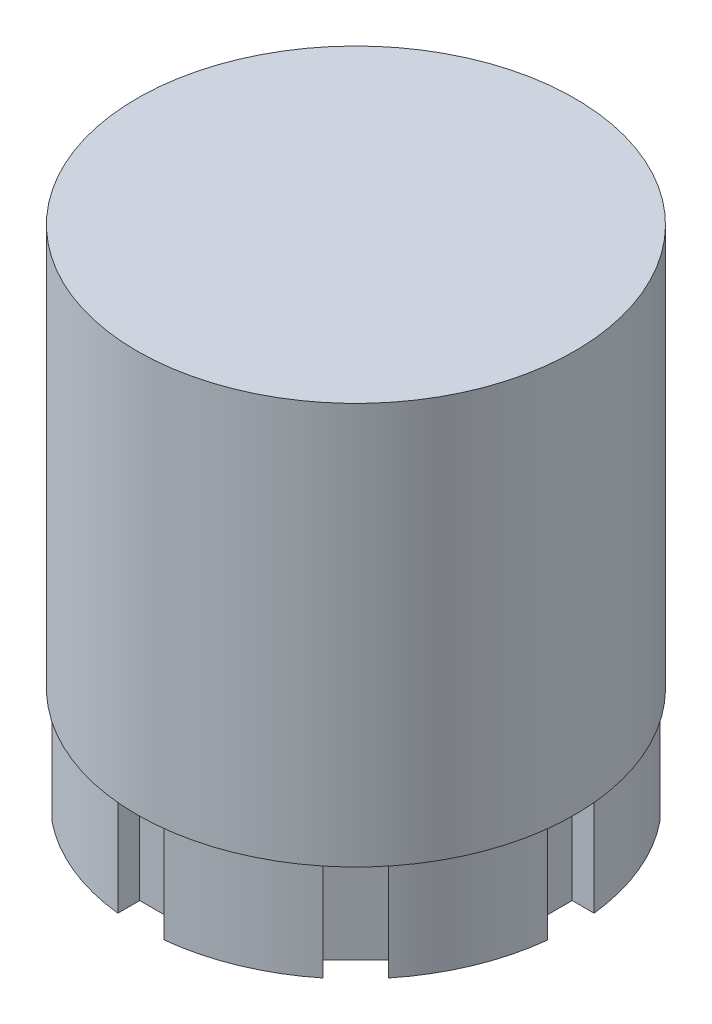
ISO-10303-21;
HEADER;
FILE_DESCRIPTION(('STEP AP214'),'2;1');
FILE_NAME('part.step','',(''),(''),'','','');
FILE_SCHEMA(('AUTOMOTIVE_DESIGN { 1 0 10303 214 1 1 1 1 }'));
ENDSEC;
DATA;
#1=APPLICATION_CONTEXT('core data for automotive mechanical design processes');
#2=APPLICATION_PROTOCOL_DEFINITION('international standard','automotive_design',2000,#1);
#3=PRODUCT_CONTEXT('',#1,'mechanical');
#4=PRODUCT('Part','Part','',(#3));
#5=PRODUCT_RELATED_PRODUCT_CATEGORY('part','',(#4));
#6=PRODUCT_DEFINITION_FORMATION('','',#4);
#7=PRODUCT_DEFINITION_CONTEXT('part definition',#1,'design');
#8=PRODUCT_DEFINITION('design','',#6,#7);
#9=PRODUCT_DEFINITION_SHAPE('','',#8);
#10=(LENGTH_UNIT() NAMED_UNIT(*) SI_UNIT(.MILLI.,.METRE.));
#11=(NAMED_UNIT(*) PLANE_ANGLE_UNIT() SI_UNIT($,.RADIAN.));
#12=(NAMED_UNIT(*) SI_UNIT($,.STERADIAN.) SOLID_ANGLE_UNIT());
#13=UNCERTAINTY_MEASURE_WITH_UNIT(LENGTH_MEASURE(1.E-05),#10,'distance_accuracy_value','');
#14=(GEOMETRIC_REPRESENTATION_CONTEXT(3) GLOBAL_UNCERTAINTY_ASSIGNED_CONTEXT((#13)) GLOBAL_UNIT_ASSIGNED_CONTEXT((#10,
#11,#12)) REPRESENTATION_CONTEXT('',''));
#15=CARTESIAN_POINT('',(0.,0.,0.));
#16=DIRECTION('',(0.,0.,1.));
#17=DIRECTION('',(1.,0.,0.));
#18=AXIS2_PLACEMENT_3D('',#15,#16,#17);
#19=CARTESIAN_POINT('',(0.,-30.7975,0.));
#20=DIRECTION('',(0.,1.,0.));
#21=DIRECTION('',(0.,0.,1.));
#22=AXIS2_PLACEMENT_3D('',#19,#20,#21);
#23=CYLINDRICAL_SURFACE('',#22,22.225);
#24=CARTESIAN_POINT('',(0.,-30.7975,0.));
#25=DIRECTION('',(0.,-1.,0.));
#26=DIRECTION('',(0.,0.,-1.));
#27=AXIS2_PLACEMENT_3D('',#24,#25,#26);
#28=CIRCLE('',#27,22.225);
#29=CARTESIAN_POINT('',(-22.0970648149816,-30.7975,-2.38125000000008));
#30=VERTEX_POINT('',#29);
#31=CARTESIAN_POINT('',(-17.3087823976926,-30.7975,-13.9411863522918));
#32=VERTEX_POINT('',#31);
#33=EDGE_CURVE('E484',#30,#32,#28,.T.);
#34=ORIENTED_EDGE('',*,*,#33,.F.);
#35=DIRECTION('',(0.,1.,0.));
#36=VECTOR('',#35,1.);
#37=CARTESIAN_POINT('',(-22.0970648149816,-30.7975,-2.38125000000008));
#38=LINE('',#37,#36);
#39=CARTESIAN_POINT('',(-22.0970648149816,-20.6375,-2.38125000000008));
#40=VERTEX_POINT('',#39);
#41=EDGE_CURVE('E422',#30,#40,#38,.T.);
#42=ORIENTED_EDGE('',*,*,#41,.T.);
#43=CARTESIAN_POINT('',(0.,-20.6375,0.));
#44=DIRECTION('',(0.,-1.,0.));
#45=DIRECTION('',(0.,0.,-1.));
#46=AXIS2_PLACEMENT_3D('',#43,#44,#45);
#47=CIRCLE('',#46,22.225);
#48=CARTESIAN_POINT('',(-17.3087823976926,-20.6375,-13.9411863522918));
#49=VERTEX_POINT('',#48);
#50=EDGE_CURVE('E490',#40,#49,#47,.T.);
#51=ORIENTED_EDGE('',*,*,#50,.T.);
#52=DIRECTION('',(0.,1.,0.));
#53=VECTOR('',#52,1.);
#54=CARTESIAN_POINT('',(-17.3087823976926,-30.7975,-13.9411863522918));
#55=LINE('',#54,#53);
#56=EDGE_CURVE('E413',#49,#32,#55,.F.);
#57=ORIENTED_EDGE('',*,*,#56,.T.);
#58=EDGE_LOOP('',(#34,#42,#51,#57));
#59=FACE_BOUND('',#58,.T.);
#60=ADVANCED_FACE('F33',(#59),#23,.T.);
#61=CARTESIAN_POINT('',(-13.9411863522916,-30.7975,-17.3087823976927));
#62=VERTEX_POINT('',#61);
#63=CARTESIAN_POINT('',(-2.38125,-30.7975,-22.0970648149816));
#64=VERTEX_POINT('',#63);
#65=EDGE_CURVE('E549',#62,#64,#28,.T.);
#66=ORIENTED_EDGE('',*,*,#65,.F.);
#67=DIRECTION('',(0.,1.,0.));
#68=VECTOR('',#67,1.);
#69=CARTESIAN_POINT('',(-13.9411863522916,-30.7975,-17.3087823976927));
#70=LINE('',#69,#68);
#71=CARTESIAN_POINT('',(-13.9411863522916,-20.6375,-17.3087823976927));
#72=VERTEX_POINT('',#71);
#73=EDGE_CURVE('E416',#62,#72,#70,.T.);
#74=ORIENTED_EDGE('',*,*,#73,.T.);
#75=CARTESIAN_POINT('',(-2.38125,-20.6375,-22.0970648149816));
#76=VERTEX_POINT('',#75);
#77=EDGE_CURVE('E492',#72,#76,#47,.T.);
#78=ORIENTED_EDGE('',*,*,#77,.T.);
#79=DIRECTION('',(0.,1.,0.));
#80=VECTOR('',#79,1.);
#81=CARTESIAN_POINT('',(-2.38125,-30.7975,-22.0970648149816));
#82=LINE('',#81,#80);
#83=EDGE_CURVE('E407',#76,#64,#82,.F.);
#84=ORIENTED_EDGE('',*,*,#83,.T.);
#85=EDGE_LOOP('',(#66,#74,#78,#84));
#86=FACE_BOUND('',#85,.T.);
#87=ADVANCED_FACE('F584',(#86),#23,.T.);
#88=CARTESIAN_POINT('',(2.38125,-30.7975,-22.0970648149816));
#89=VERTEX_POINT('',#88);
#90=CARTESIAN_POINT('',(13.9411863522919,-30.7975,-17.3087823976925));
#91=VERTEX_POINT('',#90);
#92=EDGE_CURVE('E550',#89,#91,#28,.T.);
#93=ORIENTED_EDGE('',*,*,#92,.F.);
#94=DIRECTION('',(0.,1.,0.));
#95=VECTOR('',#94,1.);
#96=CARTESIAN_POINT('',(2.38125,-30.7975,-22.0970648149816));
#97=LINE('',#96,#95);
#98=CARTESIAN_POINT('',(2.38125,-20.6375,-22.0970648149816));
#99=VERTEX_POINT('',#98);
#100=EDGE_CURVE('E410',#89,#99,#97,.T.);
#101=ORIENTED_EDGE('',*,*,#100,.T.);
#102=CARTESIAN_POINT('',(13.9411863522919,-20.6375,-17.3087823976925));
#103=VERTEX_POINT('',#102);
#104=EDGE_CURVE('E495',#99,#103,#47,.T.);
#105=ORIENTED_EDGE('',*,*,#104,.T.);
#106=DIRECTION('',(0.,1.,0.));
#107=VECTOR('',#106,1.);
#108=CARTESIAN_POINT('',(13.9411863522919,-30.7975,-17.3087823976925));
#109=LINE('',#108,#107);
#110=EDGE_CURVE('E401',#103,#91,#109,.F.);
#111=ORIENTED_EDGE('',*,*,#110,.T.);
#112=EDGE_LOOP('',(#93,#101,#105,#111));
#113=FACE_BOUND('',#112,.T.);
#114=ADVANCED_FACE('F580',(#113),#23,.T.);
#115=CARTESIAN_POINT('',(17.3087823976928,-30.7975,-13.9411863522916));
#116=VERTEX_POINT('',#115);
#117=CARTESIAN_POINT('',(22.0970648149817,-30.7975,-2.38124999999977));
#118=VERTEX_POINT('',#117);
#119=EDGE_CURVE('E553',#116,#118,#28,.T.);
#120=ORIENTED_EDGE('',*,*,#119,.F.);
#121=DIRECTION('',(0.,1.,0.));
#122=VECTOR('',#121,1.);
#123=CARTESIAN_POINT('',(17.3087823976928,-30.7975,-13.9411863522916));
#124=LINE('',#123,#122);
#125=CARTESIAN_POINT('',(17.3087823976928,-20.6375,-13.9411863522916));
#126=VERTEX_POINT('',#125);
#127=EDGE_CURVE('E404',#116,#126,#124,.T.);
#128=ORIENTED_EDGE('',*,*,#127,.T.);
#129=CARTESIAN_POINT('',(22.0970648149817,-20.6375,-2.38124999999977));
#130=VERTEX_POINT('',#129);
#131=EDGE_CURVE('E499',#126,#130,#47,.T.);
#132=ORIENTED_EDGE('',*,*,#131,.T.);
#133=DIRECTION('',(0.,1.,0.));
#134=VECTOR('',#133,1.);
#135=CARTESIAN_POINT('',(22.0970648149817,-30.7975,-2.38124999999977));
#136=LINE('',#135,#134);
#137=EDGE_CURVE('E397',#130,#118,#136,.F.);
#138=ORIENTED_EDGE('',*,*,#137,.T.);
#139=EDGE_LOOP('',(#120,#128,#132,#138));
#140=FACE_BOUND('',#139,.T.);
#141=ADVANCED_FACE('F574',(#140),#23,.T.);
#142=CARTESIAN_POINT('',(22.0970648149816,-30.7975,2.38125000000023));
#143=VERTEX_POINT('',#142);
#144=CARTESIAN_POINT('',(17.3087823976925,-30.7975,13.9411863522919));
#145=VERTEX_POINT('',#144);
#146=EDGE_CURVE('E557',#143,#145,#28,.T.);
#147=ORIENTED_EDGE('',*,*,#146,.F.);
#148=DIRECTION('',(0.,1.,0.));
#149=VECTOR('',#148,1.);
#150=CARTESIAN_POINT('',(22.0970648149816,-30.7975,2.38125000000023));
#151=LINE('',#150,#149);
#152=CARTESIAN_POINT('',(22.0970648149816,-20.6375,2.38125000000023));
#153=VERTEX_POINT('',#152);
#154=EDGE_CURVE('E250',#143,#153,#151,.T.);
#155=ORIENTED_EDGE('',*,*,#154,.T.);
#156=CARTESIAN_POINT('',(17.3087823976925,-20.6375,13.9411863522919));
#157=VERTEX_POINT('',#156);
#158=EDGE_CURVE('E503',#153,#157,#47,.T.);
#159=ORIENTED_EDGE('',*,*,#158,.T.);
#160=DIRECTION('',(0.,1.,0.));
#161=VECTOR('',#160,1.);
#162=CARTESIAN_POINT('',(17.3087823976925,-30.7975,13.9411863522919));
#163=LINE('',#162,#161);
#164=EDGE_CURVE('E391',#157,#145,#163,.F.);
#165=ORIENTED_EDGE('',*,*,#164,.T.);
#166=EDGE_LOOP('',(#147,#155,#159,#165));
#167=FACE_BOUND('',#166,.T.);
#168=ADVANCED_FACE('F572',(#167),#23,.T.);
#169=CARTESIAN_POINT('',(13.9411863522915,-30.7975,17.3087823976928));
#170=VERTEX_POINT('',#169);
#171=CARTESIAN_POINT('',(2.38125,-30.7975,22.0970648149816));
#172=VERTEX_POINT('',#171);
#173=EDGE_CURVE('E450',#170,#172,#28,.T.);
#174=ORIENTED_EDGE('',*,*,#173,.F.);
#175=DIRECTION('',(0.,1.,0.));
#176=VECTOR('',#175,1.);
#177=CARTESIAN_POINT('',(13.9411863522915,-30.7975,17.3087823976928));
#178=LINE('',#177,#176);
#179=CARTESIAN_POINT('',(13.9411863522915,-20.6375,17.3087823976928));
#180=VERTEX_POINT('',#179);
#181=EDGE_CURVE('E394',#170,#180,#178,.T.);
#182=ORIENTED_EDGE('',*,*,#181,.T.);
#183=CARTESIAN_POINT('',(2.38125,-20.6375,22.0970648149816));
#184=VERTEX_POINT('',#183);
#185=EDGE_CURVE('E461',#180,#184,#47,.T.);
#186=ORIENTED_EDGE('',*,*,#185,.T.);
#187=DIRECTION('',(0.,1.,0.));
#188=VECTOR('',#187,1.);
#189=CARTESIAN_POINT('',(2.38125,-30.7975,22.0970648149816));
#190=LINE('',#189,#188);
#191=EDGE_CURVE('E434',#184,#172,#190,.F.);
#192=ORIENTED_EDGE('',*,*,#191,.T.);
#193=EDGE_LOOP('',(#174,#182,#186,#192));
#194=FACE_BOUND('',#193,.T.);
#195=ADVANCED_FACE('F513',(#194),#23,.T.);
#196=CARTESIAN_POINT('',(-17.3087823976927,-20.6375,13.9411863522917));
#197=VERTEX_POINT('',#196);
#198=CARTESIAN_POINT('',(-22.0970648149817,-20.6375,2.38124999999992));
#199=VERTEX_POINT('',#198);
#200=EDGE_CURVE('E460',#197,#199,#47,.T.);
#201=ORIENTED_EDGE('',*,*,#200,.T.);
#202=DIRECTION('',(0.,1.,0.));
#203=VECTOR('',#202,1.);
#204=CARTESIAN_POINT('',(-22.0970648149817,-30.7975,2.38124999999992));
#205=LINE('',#204,#203);
#206=CARTESIAN_POINT('',(-22.0970648149817,-30.7975,2.38124999999992));
#207=VERTEX_POINT('',#206);
#208=EDGE_CURVE('E419',#199,#207,#205,.F.);
#209=ORIENTED_EDGE('',*,*,#208,.T.);
#210=CARTESIAN_POINT('',(-17.3087823976927,-30.7975,13.9411863522917));
#211=VERTEX_POINT('',#210);
#212=EDGE_CURVE('E455',#211,#207,#28,.T.);
#213=ORIENTED_EDGE('',*,*,#212,.F.);
#214=DIRECTION('',(0.,1.,0.));
#215=VECTOR('',#214,1.);
#216=CARTESIAN_POINT('',(-17.3087823976927,-30.7975,13.9411863522917));
#217=LINE('',#216,#215);
#218=EDGE_CURVE('E388',#211,#197,#217,.T.);
#219=ORIENTED_EDGE('',*,*,#218,.T.);
#220=EDGE_LOOP('',(#201,#209,#213,#219));
#221=FACE_BOUND('',#220,.T.);
#222=ADVANCED_FACE('F548',(#221),#23,.T.);
#223=CARTESIAN_POINT('',(0.,20.6375,0.));
#224=DIRECTION('',(0.,-1.,0.));
#225=DIRECTION('',(0.,0.,-1.));
#226=AXIS2_PLACEMENT_3D('',#223,#224,#225);
#227=CYLINDRICAL_SURFACE('',#226,22.5);
#228=CARTESIAN_POINT('',(0.,20.6375,0.));
#229=DIRECTION('',(0.,1.,0.));
#230=DIRECTION('',(0.,0.,1.));
#231=AXIS2_PLACEMENT_3D('',#228,#229,#230);
#232=CIRCLE('',#231,22.5);
#233=CARTESIAN_POINT('',(0.,20.6375,22.5));
#234=VERTEX_POINT('',#233);
#235=EDGE_CURVE('E462',#234,#234,#232,.T.);
#236=ORIENTED_EDGE('',*,*,#235,.F.);
#237=EDGE_LOOP('',(#236));
#238=FACE_BOUND('',#237,.T.);
#239=CARTESIAN_POINT('',(0.,-20.6375,0.));
#240=DIRECTION('',(0.,1.,0.));
#241=DIRECTION('',(0.,0.,1.));
#242=AXIS2_PLACEMENT_3D('',#239,#240,#241);
#243=CIRCLE('',#242,22.5);
#244=CARTESIAN_POINT('',(0.,-20.6375,22.5));
#245=VERTEX_POINT('',#244);
#246=EDGE_CURVE('E454',#245,#245,#243,.T.);
#247=ORIENTED_EDGE('',*,*,#246,.T.);
#248=EDGE_LOOP('',(#247));
#249=FACE_BOUND('',#248,.T.);
#250=ADVANCED_FACE('F35',(#238,#249),#227,.T.);
#251=CARTESIAN_POINT('',(0.,20.6375,0.));
#252=DIRECTION('',(0.,1.,0.));
#253=DIRECTION('',(0.,0.,1.));
#254=AXIS2_PLACEMENT_3D('',#251,#252,#253);
#255=PLANE('',#254);
#256=ORIENTED_EDGE('',*,*,#235,.T.);
#257=EDGE_LOOP('',(#256));
#258=FACE_BOUND('',#257,.T.);
#259=ADVANCED_FACE('F593',(#258),#255,.T.);
#260=CARTESIAN_POINT('',(0.,-20.6375,0.));
#261=DIRECTION('',(0.,1.,0.));
#262=DIRECTION('',(0.,0.,1.));
#263=AXIS2_PLACEMENT_3D('',#260,#261,#262);
#264=PLANE('',#263);
#265=ORIENTED_EDGE('',*,*,#246,.F.);
#266=EDGE_LOOP('',(#265));
#267=FACE_BOUND('',#266,.T.);
#268=ORIENTED_EDGE('',*,*,#50,.F.);
#269=DIRECTION('',(1.,0.,0.));
#270=VECTOR('',#269,1.);
#271=CARTESIAN_POINT('',(-19.84375,-20.6375,-2.38125000000007));
#272=LINE('',#271,#270);
#273=CARTESIAN_POINT('',(-19.84375,-20.6375,-2.38125000000007));
#274=VERTEX_POINT('',#273);
#275=EDGE_CURVE('E303',#40,#274,#272,.T.);
#276=ORIENTED_EDGE('',*,*,#275,.T.);
#277=DIRECTION('',(0.,0.,1.));
#278=VECTOR('',#277,1.);
#279=CARTESIAN_POINT('',(-19.84375,-20.6375,-2.38125000000007));
#280=LINE('',#279,#278);
#281=CARTESIAN_POINT('',(-19.84375,-20.6375,2.38124999999993));
#282=VERTEX_POINT('',#281);
#283=EDGE_CURVE('E312',#274,#282,#280,.T.);
#284=ORIENTED_EDGE('',*,*,#283,.T.);
#285=DIRECTION('',(-1.,0.,0.));
#286=VECTOR('',#285,1.);
#287=CARTESIAN_POINT('',(-19.84375,-20.6375,2.38124999999993));
#288=LINE('',#287,#286);
#289=EDGE_CURVE('E307',#282,#199,#288,.T.);
#290=ORIENTED_EDGE('',*,*,#289,.T.);
#291=ORIENTED_EDGE('',*,*,#200,.F.);
#292=DIRECTION('',(0.707106781186549,0.,-0.707106781186546));
#293=VECTOR('',#292,1.);
#294=CARTESIAN_POINT('',(-15.715448211871,-20.6375,12.3478521664701));
#295=LINE('',#294,#293);
#296=CARTESIAN_POINT('',(-15.715448211871,-20.6375,12.3478521664701));
#297=VERTEX_POINT('',#296);
#298=EDGE_CURVE('E370',#197,#297,#295,.T.);
#299=ORIENTED_EDGE('',*,*,#298,.T.);
#300=DIRECTION('',(0.707106781186546,0.,0.707106781186549));
#301=VECTOR('',#300,1.);
#302=CARTESIAN_POINT('',(-15.715448211871,-20.6375,12.3478521664701));
#303=LINE('',#302,#301);
#304=CARTESIAN_POINT('',(-12.3478521664701,-20.6375,15.715448211871));
#305=VERTEX_POINT('',#304);
#306=EDGE_CURVE('E377',#297,#305,#303,.T.);
#307=ORIENTED_EDGE('',*,*,#306,.T.);
#308=DIRECTION('',(-0.707106781186549,0.,0.707106781186546));
#309=VECTOR('',#308,1.);
#310=CARTESIAN_POINT('',(-12.3478521664701,-20.6375,15.715448211871));
#311=LINE('',#310,#309);
#312=CARTESIAN_POINT('',(-13.9411863522917,-20.6375,17.3087823976926));
#313=VERTEX_POINT('',#312);
#314=EDGE_CURVE('E372',#305,#313,#311,.T.);
#315=ORIENTED_EDGE('',*,*,#314,.T.);
#316=CARTESIAN_POINT('',(-2.38125,-20.6375,22.0970648149816));
#317=VERTEX_POINT('',#316);
#318=EDGE_CURVE('E456',#317,#313,#47,.T.);
#319=ORIENTED_EDGE('',*,*,#318,.F.);
#320=DIRECTION('',(0.,0.,-1.));
#321=VECTOR('',#320,1.);
#322=CARTESIAN_POINT('',(-2.38125,-20.6375,19.84375));
#323=LINE('',#322,#321);
#324=CARTESIAN_POINT('',(-2.38125,-20.6375,19.84375));
#325=VERTEX_POINT('',#324);
#326=EDGE_CURVE('E428',#317,#325,#323,.T.);
#327=ORIENTED_EDGE('',*,*,#326,.T.);
#328=DIRECTION('',(1.,0.,0.));
#329=VECTOR('',#328,1.);
#330=CARTESIAN_POINT('',(-2.38125,-20.6375,19.84375));
#331=LINE('',#330,#329);
#332=CARTESIAN_POINT('',(2.38125,-20.6375,19.84375));
#333=VERTEX_POINT('',#332);
#334=EDGE_CURVE('E436',#325,#333,#331,.T.);
#335=ORIENTED_EDGE('',*,*,#334,.T.);
#336=DIRECTION('',(0.,0.,1.));
#337=VECTOR('',#336,1.);
#338=CARTESIAN_POINT('',(2.38125,-20.6375,19.84375));
#339=LINE('',#338,#337);
#340=EDGE_CURVE('E431',#333,#184,#339,.T.);
#341=ORIENTED_EDGE('',*,*,#340,.T.);
#342=ORIENTED_EDGE('',*,*,#185,.F.);
#343=DIRECTION('',(-0.707106781186539,0.,-0.707106781186556));
#344=VECTOR('',#343,1.);
#345=CARTESIAN_POINT('',(12.3478521664699,-20.6375,15.7154482118712));
#346=LINE('',#345,#344);
#347=CARTESIAN_POINT('',(12.3478521664699,-20.6375,15.7154482118712));
#348=VERTEX_POINT('',#347);
#349=EDGE_CURVE('E287',#180,#348,#346,.T.);
#350=ORIENTED_EDGE('',*,*,#349,.T.);
#351=DIRECTION('',(0.707106781186556,0.,-0.707106781186539));
#352=VECTOR('',#351,1.);
#353=CARTESIAN_POINT('',(12.3478521664699,-20.6375,15.7154482118712));
#354=LINE('',#353,#352);
#355=CARTESIAN_POINT('',(15.7154482118709,-20.6375,12.3478521664703));
#356=VERTEX_POINT('',#355);
#357=EDGE_CURVE('E293',#348,#356,#354,.T.);
#358=ORIENTED_EDGE('',*,*,#357,.T.);
#359=DIRECTION('',(0.707106781186539,0.,0.707106781186556));
#360=VECTOR('',#359,1.);
#361=CARTESIAN_POINT('',(15.7154482118709,-20.6375,12.3478521664703));
#362=LINE('',#361,#360);
#363=EDGE_CURVE('E275',#356,#157,#362,.T.);
#364=ORIENTED_EDGE('',*,*,#363,.T.);
#365=ORIENTED_EDGE('',*,*,#158,.F.);
#366=DIRECTION('',(-1.,0.,0.));
#367=VECTOR('',#366,1.);
#368=CARTESIAN_POINT('',(19.84375,-20.6375,2.38125000000021));
#369=LINE('',#368,#367);
#370=CARTESIAN_POINT('',(19.84375,-20.6375,2.38125000000021));
#371=VERTEX_POINT('',#370);
#372=EDGE_CURVE('E266',#153,#371,#369,.T.);
#373=ORIENTED_EDGE('',*,*,#372,.T.);
#374=DIRECTION('',(0.,0.,-1.));
#375=VECTOR('',#374,1.);
#376=CARTESIAN_POINT('',(19.84375,-20.6375,2.38125000000021));
#377=LINE('',#376,#375);
#378=CARTESIAN_POINT('',(19.84375,-20.6375,-2.38124999999979));
#379=VERTEX_POINT('',#378);
#380=EDGE_CURVE('E265',#371,#379,#377,.T.);
#381=ORIENTED_EDGE('',*,*,#380,.T.);
#382=DIRECTION('',(1.,0.,0.));
#383=VECTOR('',#382,1.);
#384=CARTESIAN_POINT('',(19.84375,-20.6375,-2.38124999999979));
#385=LINE('',#384,#383);
#386=EDGE_CURVE('E278',#379,#130,#385,.T.);
#387=ORIENTED_EDGE('',*,*,#386,.T.);
#388=ORIENTED_EDGE('',*,*,#131,.F.);
#389=DIRECTION('',(-0.707106781186554,0.,0.707106781186541));
#390=VECTOR('',#389,1.);
#391=CARTESIAN_POINT('',(15.7154482118711,-20.6375,-12.3478521664699));
#392=LINE('',#391,#390);
#393=CARTESIAN_POINT('',(15.7154482118711,-20.6375,-12.3478521664699));
#394=VERTEX_POINT('',#393);
#395=EDGE_CURVE('E354',#126,#394,#392,.T.);
#396=ORIENTED_EDGE('',*,*,#395,.T.);
#397=DIRECTION('',(-0.707106781186541,0.,-0.707106781186554));
#398=VECTOR('',#397,1.);
#399=CARTESIAN_POINT('',(15.7154482118711,-20.6375,-12.3478521664699));
#400=LINE('',#399,#398);
#401=CARTESIAN_POINT('',(12.3478521664702,-20.6375,-15.7154482118709));
#402=VERTEX_POINT('',#401);
#403=EDGE_CURVE('E359',#394,#402,#400,.T.);
#404=ORIENTED_EDGE('',*,*,#403,.T.);
#405=DIRECTION('',(0.707106781186554,0.,-0.707106781186541));
#406=VECTOR('',#405,1.);
#407=CARTESIAN_POINT('',(12.3478521664702,-20.6375,-15.7154482118709));
#408=LINE('',#407,#406);
#409=EDGE_CURVE('E339',#402,#103,#408,.T.);
#410=ORIENTED_EDGE('',*,*,#409,.T.);
#411=ORIENTED_EDGE('',*,*,#104,.F.);
#412=DIRECTION('',(0.,0.,1.));
#413=VECTOR('',#412,1.);
#414=CARTESIAN_POINT('',(2.38125,-20.6375,-19.84375));
#415=LINE('',#414,#413);
#416=CARTESIAN_POINT('',(2.38125,-20.6375,-19.84375));
#417=VERTEX_POINT('',#416);
#418=EDGE_CURVE('E336',#99,#417,#415,.T.);
#419=ORIENTED_EDGE('',*,*,#418,.T.);
#420=DIRECTION('',(-1.,0.,0.));
#421=VECTOR('',#420,1.);
#422=CARTESIAN_POINT('',(2.38125,-20.6375,-19.84375));
#423=LINE('',#422,#421);
#424=CARTESIAN_POINT('',(-2.38125,-20.6375,-19.84375));
#425=VERTEX_POINT('',#424);
#426=EDGE_CURVE('E343',#417,#425,#423,.T.);
#427=ORIENTED_EDGE('',*,*,#426,.T.);
#428=DIRECTION('',(0.,0.,-1.));
#429=VECTOR('',#428,1.);
#430=CARTESIAN_POINT('',(-2.38125,-20.6375,-19.84375));
#431=LINE('',#430,#429);
#432=EDGE_CURVE('E323',#425,#76,#431,.T.);
#433=ORIENTED_EDGE('',*,*,#432,.T.);
#434=ORIENTED_EDGE('',*,*,#77,.F.);
#435=DIRECTION('',(0.707106781186544,0.,0.707106781186551));
#436=VECTOR('',#435,1.);
#437=CARTESIAN_POINT('',(-12.34785216647,-20.6375,-15.7154482118711));
#438=LINE('',#437,#436);
#439=CARTESIAN_POINT('',(-12.34785216647,-20.6375,-15.7154482118711));
#440=VERTEX_POINT('',#439);
#441=EDGE_CURVE('E320',#72,#440,#438,.T.);
#442=ORIENTED_EDGE('',*,*,#441,.T.);
#443=DIRECTION('',(-0.707106781186551,0.,0.707106781186544));
#444=VECTOR('',#443,1.);
#445=CARTESIAN_POINT('',(-12.34785216647,-20.6375,-15.7154482118711));
#446=LINE('',#445,#444);
#447=CARTESIAN_POINT('',(-15.7154482118709,-20.6375,-12.3478521664702));
#448=VERTEX_POINT('',#447);
#449=EDGE_CURVE('E327',#440,#448,#446,.T.);
#450=ORIENTED_EDGE('',*,*,#449,.T.);
#451=DIRECTION('',(-0.707106781186544,0.,-0.707106781186551));
#452=VECTOR('',#451,1.);
#453=CARTESIAN_POINT('',(-15.715448211871,-20.6375,-12.3478521664702));
#454=LINE('',#453,#452);
#455=EDGE_CURVE('E306',#448,#49,#454,.T.);
#456=ORIENTED_EDGE('',*,*,#455,.T.);
#457=EDGE_LOOP('',(#268,#276,#284,#290,#291,#299,#307,#315,#319,#327,#335,#341,#342,#350,#358,
#364,#365,#373,#381,#387,#388,#396,#404,#410,#411,#419,#427,#433,#434,#442,#450,#456));
#458=FACE_BOUND('',#457,.T.);
#459=ADVANCED_FACE('F518',(#267,#458),#264,.F.);
#460=ORIENTED_EDGE('',*,*,#318,.T.);
#461=DIRECTION('',(0.,1.,0.));
#462=VECTOR('',#461,1.);
#463=CARTESIAN_POINT('',(-13.9411863522917,-30.7975,17.3087823976926));
#464=LINE('',#463,#462);
#465=CARTESIAN_POINT('',(-13.9411863522918,-30.7975,17.3087823976926));
#466=VERTEX_POINT('',#465);
#467=EDGE_CURVE('E375',#313,#466,#464,.F.);
#468=ORIENTED_EDGE('',*,*,#467,.T.);
#469=CARTESIAN_POINT('',(-2.38125,-30.7975,22.0970648149816));
#470=VERTEX_POINT('',#469);
#471=EDGE_CURVE('E451',#470,#466,#28,.T.);
#472=ORIENTED_EDGE('',*,*,#471,.F.);
#473=DIRECTION('',(0.,1.,0.));
#474=VECTOR('',#473,1.);
#475=CARTESIAN_POINT('',(-2.38125,-30.7975,22.0970648149816));
#476=LINE('',#475,#474);
#477=EDGE_CURVE('E447',#470,#317,#476,.T.);
#478=ORIENTED_EDGE('',*,*,#477,.T.);
#479=EDGE_LOOP('',(#460,#468,#472,#478));
#480=FACE_BOUND('',#479,.T.);
#481=ADVANCED_FACE('F531',(#480),#23,.T.);
#482=CARTESIAN_POINT('',(0.,-30.7975,0.));
#483=DIRECTION('',(0.,-1.,0.));
#484=DIRECTION('',(0.,0.,-1.));
#485=AXIS2_PLACEMENT_3D('',#482,#483,#484);
#486=PLANE('',#485);
#487=DIRECTION('',(1.,0.,0.));
#488=VECTOR('',#487,1.);
#489=CARTESIAN_POINT('',(0.,-30.7975,-2.38125));
#490=LINE('',#489,#488);
#491=CARTESIAN_POINT('',(-19.84375,-30.7975,-2.38125000000007));
#492=VERTEX_POINT('',#491);
#493=EDGE_CURVE('E11',#30,#492,#490,.T.);
#494=ORIENTED_EDGE('',*,*,#493,.F.);
#495=ORIENTED_EDGE('',*,*,#33,.T.);
#496=DIRECTION('',(-0.707106781186544,0.,-0.707106781186551));
#497=VECTOR('',#496,1.);
#498=CARTESIAN_POINT('',(-15.715448211871,-30.7975,-12.3478521664702));
#499=LINE('',#498,#497);
#500=CARTESIAN_POINT('',(-15.715448211871,-30.7975,-12.3478521664702));
#501=VERTEX_POINT('',#500);
#502=EDGE_CURVE('E321',#501,#32,#499,.T.);
#503=ORIENTED_EDGE('',*,*,#502,.F.);
#504=DIRECTION('',(-0.707106781186551,0.,0.707106781186544));
#505=VECTOR('',#504,1.);
#506=CARTESIAN_POINT('',(-12.34785216647,-30.7975,-15.7154482118711));
#507=LINE('',#506,#505);
#508=CARTESIAN_POINT('',(-12.34785216647,-30.7975,-15.7154482118711));
#509=VERTEX_POINT('',#508);
#510=EDGE_CURVE('E56',#509,#501,#507,.T.);
#511=ORIENTED_EDGE('',*,*,#510,.F.);
#512=DIRECTION('',(0.707106781186544,0.,0.707106781186551));
#513=VECTOR('',#512,1.);
#514=CARTESIAN_POINT('',(1.68379802270047,-30.7975,-1.68379802270046));
#515=LINE('',#514,#513);
#516=EDGE_CURVE('E41',#62,#509,#515,.T.);
#517=ORIENTED_EDGE('',*,*,#516,.F.);
#518=ORIENTED_EDGE('',*,*,#65,.T.);
#519=DIRECTION('',(0.,0.,-1.));
#520=VECTOR('',#519,1.);
#521=CARTESIAN_POINT('',(-2.38125,-30.7975,-19.84375));
#522=LINE('',#521,#520);
#523=CARTESIAN_POINT('',(-2.38125,-30.7975,-19.84375));
#524=VERTEX_POINT('',#523);
#525=EDGE_CURVE('E337',#524,#64,#522,.T.);
#526=ORIENTED_EDGE('',*,*,#525,.F.);
#527=DIRECTION('',(-1.,0.,0.));
#528=VECTOR('',#527,1.);
#529=CARTESIAN_POINT('',(2.38125,-30.7975,-19.84375));
#530=LINE('',#529,#528);
#531=CARTESIAN_POINT('',(2.38125,-30.7975,-19.84375));
#532=VERTEX_POINT('',#531);
#533=EDGE_CURVE('E334',#532,#524,#530,.T.);
#534=ORIENTED_EDGE('',*,*,#533,.F.);
#535=DIRECTION('',(0.,0.,1.));
#536=VECTOR('',#535,1.);
#537=CARTESIAN_POINT('',(2.38125,-30.7975,0.));
#538=LINE('',#537,#536);
#539=EDGE_CURVE('E472',#89,#532,#538,.T.);
#540=ORIENTED_EDGE('',*,*,#539,.F.);
#541=ORIENTED_EDGE('',*,*,#92,.T.);
#542=DIRECTION('',(0.707106781186554,0.,-0.707106781186541));
#543=VECTOR('',#542,1.);
#544=CARTESIAN_POINT('',(12.3478521664702,-30.7975,-15.7154482118709));
#545=LINE('',#544,#543);
#546=CARTESIAN_POINT('',(12.3478521664702,-30.7975,-15.7154482118709));
#547=VERTEX_POINT('',#546);
#548=EDGE_CURVE('E281',#547,#91,#545,.T.);
#549=ORIENTED_EDGE('',*,*,#548,.F.);
#550=DIRECTION('',(-0.707106781186541,0.,-0.707106781186554));
#551=VECTOR('',#550,1.);
#552=CARTESIAN_POINT('',(15.7154482118711,-30.7975,-12.3478521664699));
#553=LINE('',#552,#551);
#554=CARTESIAN_POINT('',(15.7154482118711,-30.7975,-12.3478521664699));
#555=VERTEX_POINT('',#554);
#556=EDGE_CURVE('E352',#555,#547,#553,.T.);
#557=ORIENTED_EDGE('',*,*,#556,.F.);
#558=DIRECTION('',(-0.707106781186554,0.,0.707106781186541));
#559=VECTOR('',#558,1.);
#560=CARTESIAN_POINT('',(1.68379802270045,-30.7975,1.68379802270048));
#561=LINE('',#560,#559);
#562=EDGE_CURVE('E255',#116,#555,#561,.T.);
#563=ORIENTED_EDGE('',*,*,#562,.F.);
#564=ORIENTED_EDGE('',*,*,#119,.T.);
#565=DIRECTION('',(1.,0.,0.));
#566=VECTOR('',#565,1.);
#567=CARTESIAN_POINT('',(19.84375,-30.7975,-2.38124999999979));
#568=LINE('',#567,#566);
#569=CARTESIAN_POINT('',(19.84375,-30.7975,-2.38124999999979));
#570=VERTEX_POINT('',#569);
#571=EDGE_CURVE('E272',#570,#118,#568,.T.);
#572=ORIENTED_EDGE('',*,*,#571,.F.);
#573=DIRECTION('',(0.,0.,-1.));
#574=VECTOR('',#573,1.);
#575=CARTESIAN_POINT('',(19.84375,-30.7975,2.38125000000021));
#576=LINE('',#575,#574);
#577=CARTESIAN_POINT('',(19.84375,-30.7975,2.38125000000021));
#578=VERTEX_POINT('',#577);
#579=EDGE_CURVE('E262',#578,#570,#576,.T.);
#580=ORIENTED_EDGE('',*,*,#579,.F.);
#581=DIRECTION('',(-1.,0.,0.));
#582=VECTOR('',#581,1.);
#583=CARTESIAN_POINT('',(0.,-30.7975,2.38125));
#584=LINE('',#583,#582);
#585=EDGE_CURVE('E245',#143,#578,#584,.T.);
#586=ORIENTED_EDGE('',*,*,#585,.F.);
#587=ORIENTED_EDGE('',*,*,#146,.T.);
#588=DIRECTION('',(0.707106781186539,0.,0.707106781186556));
#589=VECTOR('',#588,1.);
#590=CARTESIAN_POINT('',(15.7154482118709,-30.7975,12.3478521664703));
#591=LINE('',#590,#589);
#592=CARTESIAN_POINT('',(15.7154482118709,-30.7975,12.3478521664703));
#593=VERTEX_POINT('',#592);
#594=EDGE_CURVE('E288',#593,#145,#591,.T.);
#595=ORIENTED_EDGE('',*,*,#594,.F.);
#596=DIRECTION('',(0.707106781186556,0.,-0.707106781186539));
#597=VECTOR('',#596,1.);
#598=CARTESIAN_POINT('',(12.3478521664699,-30.7975,15.7154482118712));
#599=LINE('',#598,#597);
#600=CARTESIAN_POINT('',(12.3478521664699,-30.7975,15.7154482118712));
#601=VERTEX_POINT('',#600);
#602=EDGE_CURVE('E285',#601,#593,#599,.T.);
#603=ORIENTED_EDGE('',*,*,#602,.F.);
#604=DIRECTION('',(-0.707106781186539,0.,-0.707106781186556));
#605=VECTOR('',#604,1.);
#606=CARTESIAN_POINT('',(-1.68379802270049,-30.7975,1.68379802270045));
#607=LINE('',#606,#605);
#608=EDGE_CURVE('E256',#170,#601,#607,.T.);
#609=ORIENTED_EDGE('',*,*,#608,.F.);
#610=ORIENTED_EDGE('',*,*,#173,.T.);
#611=DIRECTION('',(0.,0.,1.));
#612=VECTOR('',#611,1.);
#613=CARTESIAN_POINT('',(2.38125,-30.7975,19.84375));
#614=LINE('',#613,#612);
#615=CARTESIAN_POINT('',(2.38125,-30.7975,19.84375));
#616=VERTEX_POINT('',#615);
#617=EDGE_CURVE('E425',#616,#172,#614,.T.);
#618=ORIENTED_EDGE('',*,*,#617,.F.);
#619=DIRECTION('',(1.,0.,0.));
#620=VECTOR('',#619,1.);
#621=CARTESIAN_POINT('',(-2.38125,-30.7975,19.84375));
#622=LINE('',#621,#620);
#623=CARTESIAN_POINT('',(-2.38125,-30.7975,19.84375));
#624=VERTEX_POINT('',#623);
#625=EDGE_CURVE('E426',#624,#616,#622,.T.);
#626=ORIENTED_EDGE('',*,*,#625,.F.);
#627=DIRECTION('',(0.,0.,-1.));
#628=VECTOR('',#627,1.);
#629=CARTESIAN_POINT('',(-2.38125,-30.7975,0.));
#630=LINE('',#629,#628);
#631=EDGE_CURVE('E459',#470,#624,#630,.T.);
#632=ORIENTED_EDGE('',*,*,#631,.F.);
#633=ORIENTED_EDGE('',*,*,#471,.T.);
#634=DIRECTION('',(-0.707106781186549,0.,0.707106781186546));
#635=VECTOR('',#634,1.);
#636=CARTESIAN_POINT('',(-12.3478521664701,-30.7975,15.715448211871));
#637=LINE('',#636,#635);
#638=CARTESIAN_POINT('',(-12.3478521664701,-30.7975,15.715448211871));
#639=VERTEX_POINT('',#638);
#640=EDGE_CURVE('E310',#639,#466,#637,.T.);
#641=ORIENTED_EDGE('',*,*,#640,.F.);
#642=DIRECTION('',(0.707106781186546,0.,0.707106781186549));
#643=VECTOR('',#642,1.);
#644=CARTESIAN_POINT('',(-15.715448211871,-30.7975,12.3478521664701));
#645=LINE('',#644,#643);
#646=CARTESIAN_POINT('',(-15.715448211871,-30.7975,12.3478521664701));
#647=VERTEX_POINT('',#646);
#648=EDGE_CURVE('E368',#647,#639,#645,.T.);
#649=ORIENTED_EDGE('',*,*,#648,.F.);
#650=DIRECTION('',(0.707106781186549,0.,-0.707106781186546));
#651=VECTOR('',#650,1.);
#652=CARTESIAN_POINT('',(-1.68379802270046,-30.7975,-1.68379802270047));
#653=LINE('',#652,#651);
#654=EDGE_CURVE('E468',#211,#647,#653,.T.);
#655=ORIENTED_EDGE('',*,*,#654,.F.);
#656=ORIENTED_EDGE('',*,*,#212,.T.);
#657=DIRECTION('',(-1.,0.,0.));
#658=VECTOR('',#657,1.);
#659=CARTESIAN_POINT('',(-19.84375,-30.7975,2.38124999999993));
#660=LINE('',#659,#658);
#661=CARTESIAN_POINT('',(-19.84375,-30.7975,2.38124999999993));
#662=VERTEX_POINT('',#661);
#663=EDGE_CURVE('E304',#662,#207,#660,.T.);
#664=ORIENTED_EDGE('',*,*,#663,.F.);
#665=DIRECTION('',(0.,0.,1.));
#666=VECTOR('',#665,1.);
#667=CARTESIAN_POINT('',(-19.84375,-30.7975,-2.38125000000007));
#668=LINE('',#667,#666);
#669=EDGE_CURVE('E48',#492,#662,#668,.T.);
#670=ORIENTED_EDGE('',*,*,#669,.F.);
#671=EDGE_LOOP('',(#494,#495,#503,#511,#517,#518,#526,#534,#540,#541,#549,#557,#563,#564,#572,
#580,#586,#587,#595,#603,#609,#610,#618,#626,#632,#633,#641,#649,#655,#656,#664,#670));
#672=FACE_BOUND('',#671,.T.);
#673=ADVANCED_FACE('F270',(#672),#486,.T.);
#674=CARTESIAN_POINT('',(-2.38125,-13.9023079091981,19.84375));
#675=DIRECTION('',(-1.,0.,0.));
#676=DIRECTION('',(0.,0.,1.));
#677=AXIS2_PLACEMENT_3D('',#674,#675,#676);
#678=PLANE('',#677);
#679=ORIENTED_EDGE('',*,*,#631,.T.);
#680=DIRECTION('',(0.,-1.,0.));
#681=VECTOR('',#680,1.);
#682=CARTESIAN_POINT('',(-2.38125,-13.9023079091981,19.84375));
#683=LINE('',#682,#681);
#684=EDGE_CURVE('E439',#325,#624,#683,.T.);
#685=ORIENTED_EDGE('',*,*,#684,.F.);
#686=ORIENTED_EDGE('',*,*,#326,.F.);
#687=ORIENTED_EDGE('',*,*,#477,.F.);
#688=EDGE_LOOP('',(#679,#685,#686,#687));
#689=FACE_BOUND('',#688,.T.);
#690=ADVANCED_FACE('F526',(#689),#678,.F.);
#691=CARTESIAN_POINT('',(2.38125,-13.9023079091981,19.84375));
#692=DIRECTION('',(1.,0.,0.));
#693=DIRECTION('',(0.,0.,-1.));
#694=AXIS2_PLACEMENT_3D('',#691,#692,#693);
#695=PLANE('',#694);
#696=ORIENTED_EDGE('',*,*,#340,.F.);
#697=DIRECTION('',(0.,-1.,0.));
#698=VECTOR('',#697,1.);
#699=CARTESIAN_POINT('',(2.38125,-13.9023079091981,19.84375));
#700=LINE('',#699,#698);
#701=EDGE_CURVE('E435',#333,#616,#700,.T.);
#702=ORIENTED_EDGE('',*,*,#701,.T.);
#703=ORIENTED_EDGE('',*,*,#617,.T.);
#704=ORIENTED_EDGE('',*,*,#191,.F.);
#705=EDGE_LOOP('',(#696,#702,#703,#704));
#706=FACE_BOUND('',#705,.T.);
#707=ADVANCED_FACE('F515',(#706),#695,.F.);
#708=CARTESIAN_POINT('',(-2.38125,-13.9023079091981,19.84375));
#709=DIRECTION('',(0.,0.,-1.));
#710=DIRECTION('',(-1.,0.,0.));
#711=AXIS2_PLACEMENT_3D('',#708,#709,#710);
#712=PLANE('',#711);
#713=ORIENTED_EDGE('',*,*,#684,.T.);
#714=ORIENTED_EDGE('',*,*,#625,.T.);
#715=ORIENTED_EDGE('',*,*,#701,.F.);
#716=ORIENTED_EDGE('',*,*,#334,.F.);
#717=EDGE_LOOP('',(#713,#714,#715,#716));
#718=FACE_BOUND('',#717,.T.);
#719=ADVANCED_FACE('F523',(#718),#712,.F.);
#720=CARTESIAN_POINT('',(-15.715448211871,-11.1125,12.3478521664701));
#721=DIRECTION('',(-0.707106781186546,0.,-0.707106781186549));
#722=DIRECTION('',(-0.707106781186549,0.,0.707106781186546));
#723=AXIS2_PLACEMENT_3D('',#720,#721,#722);
#724=PLANE('',#723);
#725=ORIENTED_EDGE('',*,*,#654,.T.);
#726=DIRECTION('',(0.,-1.,0.));
#727=VECTOR('',#726,1.);
#728=CARTESIAN_POINT('',(-15.715448211871,-11.1125,12.3478521664701));
#729=LINE('',#728,#727);
#730=EDGE_CURVE('E380',#297,#647,#729,.T.);
#731=ORIENTED_EDGE('',*,*,#730,.F.);
#732=ORIENTED_EDGE('',*,*,#298,.F.);
#733=ORIENTED_EDGE('',*,*,#218,.F.);
#734=EDGE_LOOP('',(#725,#731,#732,#733));
#735=FACE_BOUND('',#734,.T.);
#736=ADVANCED_FACE('F542',(#735),#724,.F.);
#737=CARTESIAN_POINT('',(-12.3478521664701,-11.1125,15.715448211871));
#738=DIRECTION('',(0.707106781186546,0.,0.707106781186549));
#739=DIRECTION('',(0.707106781186549,0.,-0.707106781186546));
#740=AXIS2_PLACEMENT_3D('',#737,#738,#739);
#741=PLANE('',#740);
#742=ORIENTED_EDGE('',*,*,#314,.F.);
#743=DIRECTION('',(0.,-1.,0.));
#744=VECTOR('',#743,1.);
#745=CARTESIAN_POINT('',(-12.3478521664701,-11.1125,15.715448211871));
#746=LINE('',#745,#744);
#747=EDGE_CURVE('E376',#305,#639,#746,.T.);
#748=ORIENTED_EDGE('',*,*,#747,.T.);
#749=ORIENTED_EDGE('',*,*,#640,.T.);
#750=ORIENTED_EDGE('',*,*,#467,.F.);
#751=EDGE_LOOP('',(#742,#748,#749,#750));
#752=FACE_BOUND('',#751,.T.);
#753=ADVANCED_FACE('F533',(#752),#741,.F.);
#754=CARTESIAN_POINT('',(-15.715448211871,-11.1125,12.3478521664701));
#755=DIRECTION('',(0.707106781186549,0.,-0.707106781186546));
#756=DIRECTION('',(-0.707106781186546,0.,-0.707106781186549));
#757=AXIS2_PLACEMENT_3D('',#754,#755,#756);
#758=PLANE('',#757);
#759=ORIENTED_EDGE('',*,*,#730,.T.);
#760=ORIENTED_EDGE('',*,*,#648,.T.);
#761=ORIENTED_EDGE('',*,*,#747,.F.);
#762=ORIENTED_EDGE('',*,*,#306,.F.);
#763=EDGE_LOOP('',(#759,#760,#761,#762));
#764=FACE_BOUND('',#763,.T.);
#765=ADVANCED_FACE('F539',(#764),#758,.F.);
#766=CARTESIAN_POINT('',(12.3478521664699,-11.1125,15.7154482118712));
#767=DIRECTION('',(-0.707106781186556,0.,0.707106781186539));
#768=DIRECTION('',(0.707106781186539,0.,0.707106781186556));
#769=AXIS2_PLACEMENT_3D('',#766,#767,#768);
#770=PLANE('',#769);
#771=ORIENTED_EDGE('',*,*,#608,.T.);
#772=DIRECTION('',(0.,-1.,0.));
#773=VECTOR('',#772,1.);
#774=CARTESIAN_POINT('',(12.3478521664699,-11.1125,15.7154482118712));
#775=LINE('',#774,#773);
#776=EDGE_CURVE('E296',#348,#601,#775,.T.);
#777=ORIENTED_EDGE('',*,*,#776,.F.);
#778=ORIENTED_EDGE('',*,*,#349,.F.);
#779=ORIENTED_EDGE('',*,*,#181,.F.);
#780=EDGE_LOOP('',(#771,#777,#778,#779));
#781=FACE_BOUND('',#780,.T.);
#782=ADVANCED_FACE('F565',(#781),#770,.F.);
#783=CARTESIAN_POINT('',(15.7154482118709,-11.1125,12.3478521664703));
#784=DIRECTION('',(0.707106781186556,0.,-0.707106781186539));
#785=DIRECTION('',(-0.707106781186539,0.,-0.707106781186556));
#786=AXIS2_PLACEMENT_3D('',#783,#784,#785);
#787=PLANE('',#786);
#788=ORIENTED_EDGE('',*,*,#363,.F.);
#789=DIRECTION('',(0.,-1.,0.));
#790=VECTOR('',#789,1.);
#791=CARTESIAN_POINT('',(15.7154482118709,-11.1125,12.3478521664703));
#792=LINE('',#791,#790);
#793=EDGE_CURVE('E292',#356,#593,#792,.T.);
#794=ORIENTED_EDGE('',*,*,#793,.T.);
#795=ORIENTED_EDGE('',*,*,#594,.T.);
#796=ORIENTED_EDGE('',*,*,#164,.F.);
#797=EDGE_LOOP('',(#788,#794,#795,#796));
#798=FACE_BOUND('',#797,.T.);
#799=ADVANCED_FACE('F571',(#798),#787,.F.);
#800=CARTESIAN_POINT('',(12.3478521664699,-11.1125,15.7154482118712));
#801=DIRECTION('',(-0.707106781186539,0.,-0.707106781186556));
#802=DIRECTION('',(-0.707106781186556,0.,0.707106781186539));
#803=AXIS2_PLACEMENT_3D('',#800,#801,#802);
#804=PLANE('',#803);
#805=ORIENTED_EDGE('',*,*,#776,.T.);
#806=ORIENTED_EDGE('',*,*,#602,.T.);
#807=ORIENTED_EDGE('',*,*,#793,.F.);
#808=ORIENTED_EDGE('',*,*,#357,.F.);
#809=EDGE_LOOP('',(#805,#806,#807,#808));
#810=FACE_BOUND('',#809,.T.);
#811=ADVANCED_FACE('F568',(#810),#804,.F.);
#812=CARTESIAN_POINT('',(19.84375,-13.9023079091981,2.38125000000021));
#813=DIRECTION('',(0.,0.,1.));
#814=DIRECTION('',(1.,0.,0.));
#815=AXIS2_PLACEMENT_3D('',#812,#813,#814);
#816=PLANE('',#815);
#817=ORIENTED_EDGE('',*,*,#585,.T.);
#818=DIRECTION('',(0.,-1.,0.));
#819=VECTOR('',#818,1.);
#820=CARTESIAN_POINT('',(19.84375,-13.9023079091981,2.38125000000021));
#821=LINE('',#820,#819);
#822=EDGE_CURVE('E248',#371,#578,#821,.T.);
#823=ORIENTED_EDGE('',*,*,#822,.F.);
#824=ORIENTED_EDGE('',*,*,#372,.F.);
#825=ORIENTED_EDGE('',*,*,#154,.F.);
#826=EDGE_LOOP('',(#817,#823,#824,#825));
#827=FACE_BOUND('',#826,.T.);
#828=ADVANCED_FACE('F247',(#827),#816,.F.);
#829=CARTESIAN_POINT('',(19.84375,-13.9023079091981,-2.38124999999979));
#830=DIRECTION('',(0.,0.,-1.));
#831=DIRECTION('',(-1.,0.,0.));
#832=AXIS2_PLACEMENT_3D('',#829,#830,#831);
#833=PLANE('',#832);
#834=ORIENTED_EDGE('',*,*,#386,.F.);
#835=DIRECTION('',(0.,-1.,0.));
#836=VECTOR('',#835,1.);
#837=CARTESIAN_POINT('',(19.84375,-13.9023079091981,-2.38124999999979));
#838=LINE('',#837,#836);
#839=EDGE_CURVE('E282',#379,#570,#838,.T.);
#840=ORIENTED_EDGE('',*,*,#839,.T.);
#841=ORIENTED_EDGE('',*,*,#571,.T.);
#842=ORIENTED_EDGE('',*,*,#137,.F.);
#843=EDGE_LOOP('',(#834,#840,#841,#842));
#844=FACE_BOUND('',#843,.T.);
#845=ADVANCED_FACE('F688',(#844),#833,.F.);
#846=CARTESIAN_POINT('',(19.84375,-13.9023079091981,2.38125000000021));
#847=DIRECTION('',(-1.,0.,0.));
#848=DIRECTION('',(0.,0.,1.));
#849=AXIS2_PLACEMENT_3D('',#846,#847,#848);
#850=PLANE('',#849);
#851=ORIENTED_EDGE('',*,*,#822,.T.);
#852=ORIENTED_EDGE('',*,*,#579,.T.);
#853=ORIENTED_EDGE('',*,*,#839,.F.);
#854=ORIENTED_EDGE('',*,*,#380,.F.);
#855=EDGE_LOOP('',(#851,#852,#853,#854));
#856=FACE_BOUND('',#855,.T.);
#857=ADVANCED_FACE('F260',(#856),#850,.F.);
#858=CARTESIAN_POINT('',(15.7154482118711,-11.1125,-12.3478521664699));
#859=DIRECTION('',(0.707106781186541,0.,0.707106781186554));
#860=DIRECTION('',(0.707106781186554,0.,-0.707106781186541));
#861=AXIS2_PLACEMENT_3D('',#858,#859,#860);
#862=PLANE('',#861);
#863=ORIENTED_EDGE('',*,*,#562,.T.);
#864=DIRECTION('',(0.,-1.,0.));
#865=VECTOR('',#864,1.);
#866=CARTESIAN_POINT('',(15.7154482118711,-11.1125,-12.3478521664699));
#867=LINE('',#866,#865);
#868=EDGE_CURVE('E362',#394,#555,#867,.T.);
#869=ORIENTED_EDGE('',*,*,#868,.F.);
#870=ORIENTED_EDGE('',*,*,#395,.F.);
#871=ORIENTED_EDGE('',*,*,#127,.F.);
#872=EDGE_LOOP('',(#863,#869,#870,#871));
#873=FACE_BOUND('',#872,.T.);
#874=ADVANCED_FACE('F706',(#873),#862,.F.);
#875=CARTESIAN_POINT('',(12.3478521664702,-11.1125,-15.7154482118709));
#876=DIRECTION('',(-0.707106781186541,0.,-0.707106781186554));
#877=DIRECTION('',(-0.707106781186554,0.,0.707106781186541));
#878=AXIS2_PLACEMENT_3D('',#875,#876,#877);
#879=PLANE('',#878);
#880=ORIENTED_EDGE('',*,*,#409,.F.);
#881=DIRECTION('',(0.,-1.,0.));
#882=VECTOR('',#881,1.);
#883=CARTESIAN_POINT('',(12.3478521664702,-11.1125,-15.7154482118709));
#884=LINE('',#883,#882);
#885=EDGE_CURVE('E358',#402,#547,#884,.T.);
#886=ORIENTED_EDGE('',*,*,#885,.T.);
#887=ORIENTED_EDGE('',*,*,#548,.T.);
#888=ORIENTED_EDGE('',*,*,#110,.F.);
#889=EDGE_LOOP('',(#880,#886,#887,#888));
#890=FACE_BOUND('',#889,.T.);
#891=ADVANCED_FACE('F715',(#890),#879,.F.);
#892=CARTESIAN_POINT('',(15.7154482118711,-11.1125,-12.3478521664699));
#893=DIRECTION('',(-0.707106781186554,0.,0.707106781186541));
#894=DIRECTION('',(0.707106781186541,0.,0.707106781186554));
#895=AXIS2_PLACEMENT_3D('',#892,#893,#894);
#896=PLANE('',#895);
#897=ORIENTED_EDGE('',*,*,#868,.T.);
#898=ORIENTED_EDGE('',*,*,#556,.T.);
#899=ORIENTED_EDGE('',*,*,#885,.F.);
#900=ORIENTED_EDGE('',*,*,#403,.F.);
#901=EDGE_LOOP('',(#897,#898,#899,#900));
#902=FACE_BOUND('',#901,.T.);
#903=ADVANCED_FACE('F725',(#902),#896,.F.);
#904=CARTESIAN_POINT('',(2.38125,-13.9023079091981,-19.84375));
#905=DIRECTION('',(1.,0.,0.));
#906=DIRECTION('',(0.,0.,-1.));
#907=AXIS2_PLACEMENT_3D('',#904,#905,#906);
#908=PLANE('',#907);
#909=ORIENTED_EDGE('',*,*,#539,.T.);
#910=DIRECTION('',(0.,-1.,0.));
#911=VECTOR('',#910,1.);
#912=CARTESIAN_POINT('',(2.38125,-13.9023079091981,-19.84375));
#913=LINE('',#912,#911);
#914=EDGE_CURVE('E346',#417,#532,#913,.T.);
#915=ORIENTED_EDGE('',*,*,#914,.F.);
#916=ORIENTED_EDGE('',*,*,#418,.F.);
#917=ORIENTED_EDGE('',*,*,#100,.F.);
#918=EDGE_LOOP('',(#909,#915,#916,#917));
#919=FACE_BOUND('',#918,.T.);
#920=ADVANCED_FACE('F735',(#919),#908,.F.);
#921=CARTESIAN_POINT('',(-2.38125,-13.9023079091981,-19.84375));
#922=DIRECTION('',(-1.,0.,0.));
#923=DIRECTION('',(0.,0.,1.));
#924=AXIS2_PLACEMENT_3D('',#921,#922,#923);
#925=PLANE('',#924);
#926=ORIENTED_EDGE('',*,*,#432,.F.);
#927=DIRECTION('',(0.,-1.,0.));
#928=VECTOR('',#927,1.);
#929=CARTESIAN_POINT('',(-2.38125,-13.9023079091981,-19.84375));
#930=LINE('',#929,#928);
#931=EDGE_CURVE('E342',#425,#524,#930,.T.);
#932=ORIENTED_EDGE('',*,*,#931,.T.);
#933=ORIENTED_EDGE('',*,*,#525,.T.);
#934=ORIENTED_EDGE('',*,*,#83,.F.);
#935=EDGE_LOOP('',(#926,#932,#933,#934));
#936=FACE_BOUND('',#935,.T.);
#937=ADVANCED_FACE('F745',(#936),#925,.F.);
#938=CARTESIAN_POINT('',(2.38125,-13.9023079091981,-19.84375));
#939=DIRECTION('',(0.,0.,1.));
#940=DIRECTION('',(1.,0.,0.));
#941=AXIS2_PLACEMENT_3D('',#938,#939,#940);
#942=PLANE('',#941);
#943=ORIENTED_EDGE('',*,*,#914,.T.);
#944=ORIENTED_EDGE('',*,*,#533,.T.);
#945=ORIENTED_EDGE('',*,*,#931,.F.);
#946=ORIENTED_EDGE('',*,*,#426,.F.);
#947=EDGE_LOOP('',(#943,#944,#945,#946));
#948=FACE_BOUND('',#947,.T.);
#949=ADVANCED_FACE('F755',(#948),#942,.F.);
#950=CARTESIAN_POINT('',(-12.34785216647,-11.1125,-15.7154482118711));
#951=DIRECTION('',(0.707106781186551,0.,-0.707106781186544));
#952=DIRECTION('',(-0.707106781186544,0.,-0.707106781186551));
#953=AXIS2_PLACEMENT_3D('',#950,#951,#952);
#954=PLANE('',#953);
#955=ORIENTED_EDGE('',*,*,#516,.T.);
#956=DIRECTION('',(0.,-1.,0.));
#957=VECTOR('',#956,1.);
#958=CARTESIAN_POINT('',(-12.34785216647,-11.1125,-15.7154482118711));
#959=LINE('',#958,#957);
#960=EDGE_CURVE('E330',#440,#509,#959,.T.);
#961=ORIENTED_EDGE('',*,*,#960,.F.);
#962=ORIENTED_EDGE('',*,*,#441,.F.);
#963=ORIENTED_EDGE('',*,*,#73,.F.);
#964=EDGE_LOOP('',(#955,#961,#962,#963));
#965=FACE_BOUND('',#964,.T.);
#966=ADVANCED_FACE('F476',(#965),#954,.F.);
#967=CARTESIAN_POINT('',(-15.715448211871,-11.1125,-12.3478521664702));
#968=DIRECTION('',(-0.707106781186551,0.,0.707106781186544));
#969=DIRECTION('',(0.707106781186544,0.,0.707106781186551));
#970=AXIS2_PLACEMENT_3D('',#967,#968,#969);
#971=PLANE('',#970);
#972=ORIENTED_EDGE('',*,*,#455,.F.);
#973=DIRECTION('',(0.,-1.,0.));
#974=VECTOR('',#973,1.);
#975=CARTESIAN_POINT('',(-15.715448211871,-11.1125,-12.3478521664702));
#976=LINE('',#975,#974);
#977=EDGE_CURVE('E326',#448,#501,#976,.T.);
#978=ORIENTED_EDGE('',*,*,#977,.T.);
#979=ORIENTED_EDGE('',*,*,#502,.T.);
#980=ORIENTED_EDGE('',*,*,#56,.F.);
#981=EDGE_LOOP('',(#972,#978,#979,#980));
#982=FACE_BOUND('',#981,.T.);
#983=ADVANCED_FACE('F486',(#982),#971,.F.);
#984=CARTESIAN_POINT('',(-12.34785216647,-11.1125,-15.7154482118711));
#985=DIRECTION('',(0.707106781186544,0.,0.707106781186551));
#986=DIRECTION('',(0.707106781186551,0.,-0.707106781186544));
#987=AXIS2_PLACEMENT_3D('',#984,#985,#986);
#988=PLANE('',#987);
#989=ORIENTED_EDGE('',*,*,#960,.T.);
#990=ORIENTED_EDGE('',*,*,#510,.T.);
#991=ORIENTED_EDGE('',*,*,#977,.F.);
#992=ORIENTED_EDGE('',*,*,#449,.F.);
#993=EDGE_LOOP('',(#989,#990,#991,#992));
#994=FACE_BOUND('',#993,.T.);
#995=ADVANCED_FACE('F480',(#994),#988,.F.);
#996=CARTESIAN_POINT('',(-19.84375,-13.9023079091981,-2.38125000000007));
#997=DIRECTION('',(0.,0.,-1.));
#998=DIRECTION('',(-1.,0.,0.));
#999=AXIS2_PLACEMENT_3D('',#996,#997,#998);
#1000=PLANE('',#999);
#1001=ORIENTED_EDGE('',*,*,#493,.T.);
#1002=DIRECTION('',(0.,-1.,0.));
#1003=VECTOR('',#1002,1.);
#1004=CARTESIAN_POINT('',(-19.84375,-13.9023079091981,-2.38125000000007));
#1005=LINE('',#1004,#1003);
#1006=EDGE_CURVE('E315',#274,#492,#1005,.T.);
#1007=ORIENTED_EDGE('',*,*,#1006,.F.);
#1008=ORIENTED_EDGE('',*,*,#275,.F.);
#1009=ORIENTED_EDGE('',*,*,#41,.F.);
#1010=EDGE_LOOP('',(#1001,#1007,#1008,#1009));
#1011=FACE_BOUND('',#1010,.T.);
#1012=ADVANCED_FACE('F790',(#1011),#1000,.F.);
#1013=CARTESIAN_POINT('',(-19.84375,-13.9023079091981,2.38124999999993));
#1014=DIRECTION('',(0.,0.,1.));
#1015=DIRECTION('',(1.,0.,0.));
#1016=AXIS2_PLACEMENT_3D('',#1013,#1014,#1015);
#1017=PLANE('',#1016);
#1018=ORIENTED_EDGE('',*,*,#289,.F.);
#1019=DIRECTION('',(0.,-1.,0.));
#1020=VECTOR('',#1019,1.);
#1021=CARTESIAN_POINT('',(-19.84375,-13.9023079091981,2.38124999999993));
#1022=LINE('',#1021,#1020);
#1023=EDGE_CURVE('E311',#282,#662,#1022,.T.);
#1024=ORIENTED_EDGE('',*,*,#1023,.T.);
#1025=ORIENTED_EDGE('',*,*,#663,.T.);
#1026=ORIENTED_EDGE('',*,*,#208,.F.);
#1027=EDGE_LOOP('',(#1018,#1024,#1025,#1026));
#1028=FACE_BOUND('',#1027,.T.);
#1029=ADVANCED_FACE('F799',(#1028),#1017,.F.);
#1030=CARTESIAN_POINT('',(-19.84375,-13.9023079091981,-2.38125000000007));
#1031=DIRECTION('',(1.,0.,0.));
#1032=DIRECTION('',(0.,0.,-1.));
#1033=AXIS2_PLACEMENT_3D('',#1030,#1031,#1032);
#1034=PLANE('',#1033);
#1035=ORIENTED_EDGE('',*,*,#1006,.T.);
#1036=ORIENTED_EDGE('',*,*,#669,.T.);
#1037=ORIENTED_EDGE('',*,*,#1023,.F.);
#1038=ORIENTED_EDGE('',*,*,#283,.F.);
#1039=EDGE_LOOP('',(#1035,#1036,#1037,#1038));
#1040=FACE_BOUND('',#1039,.T.);
#1041=ADVANCED_FACE('F809',(#1040),#1034,.F.);
#1042=CLOSED_SHELL('',(#60,#87,#114,#141,#168,#195,#222,#250,#259,#459,#481,#673,#690,#707,#719,
#736,#753,#765,#782,#799,#811,#828,#845,#857,#874,#891,#903,#920,#937,#949,#966,#983,#995,#1012,
#1029,#1041));
#1043=MANIFOLD_SOLID_BREP('B2',#1042);
#1044=ADVANCED_BREP_SHAPE_REPRESENTATION('',(#18,#1043),#14);
#1045=SHAPE_DEFINITION_REPRESENTATION(#9,#1044);
ENDSEC;
END-ISO-10303-21;
